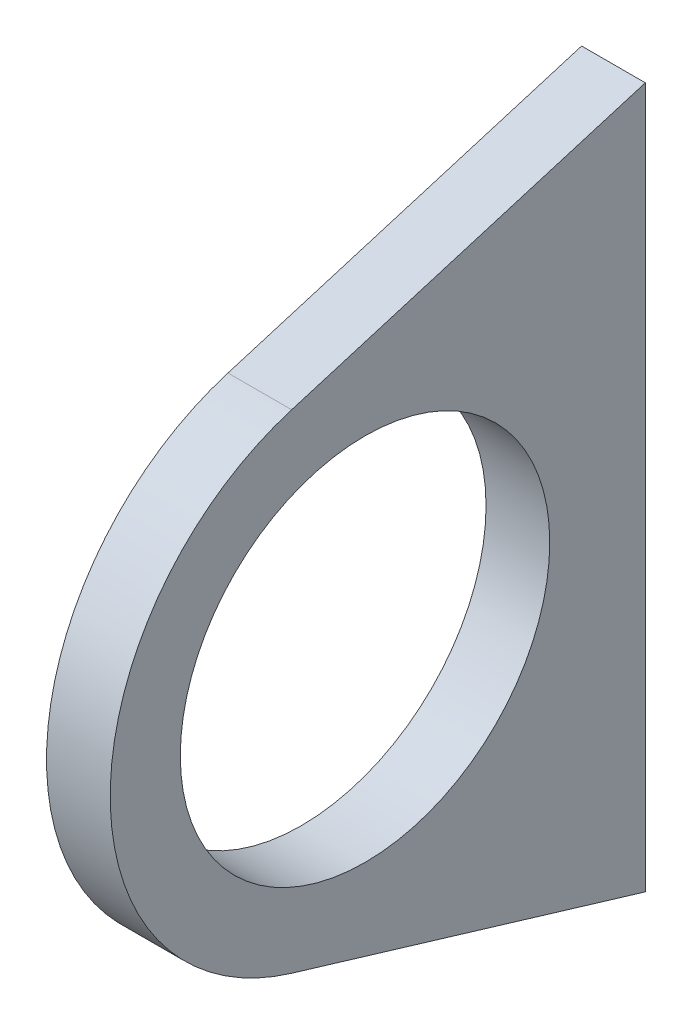
ISO-10303-21;
HEADER;
FILE_DESCRIPTION(('STEP AP214'),'2;1');
FILE_NAME('part.step','',(''),(''),'','','');
FILE_SCHEMA(('AUTOMOTIVE_DESIGN { 1 0 10303 214 1 1 1 1 }'));
ENDSEC;
DATA;
#1=APPLICATION_CONTEXT('core data for automotive mechanical design processes');
#2=APPLICATION_PROTOCOL_DEFINITION('international standard','automotive_design',2000,#1);
#3=PRODUCT_CONTEXT('',#1,'mechanical');
#4=PRODUCT('Part','Part','',(#3));
#5=PRODUCT_RELATED_PRODUCT_CATEGORY('part','',(#4));
#6=PRODUCT_DEFINITION_FORMATION('','',#4);
#7=PRODUCT_DEFINITION_CONTEXT('part definition',#1,'design');
#8=PRODUCT_DEFINITION('design','',#6,#7);
#9=PRODUCT_DEFINITION_SHAPE('','',#8);
#10=(LENGTH_UNIT() NAMED_UNIT(*) SI_UNIT(.MILLI.,.METRE.));
#11=(NAMED_UNIT(*) PLANE_ANGLE_UNIT() SI_UNIT($,.RADIAN.));
#12=(NAMED_UNIT(*) SI_UNIT($,.STERADIAN.) SOLID_ANGLE_UNIT());
#13=UNCERTAINTY_MEASURE_WITH_UNIT(LENGTH_MEASURE(1.E-05),#10,'distance_accuracy_value','');
#14=(GEOMETRIC_REPRESENTATION_CONTEXT(3) GLOBAL_UNCERTAINTY_ASSIGNED_CONTEXT((#13)) GLOBAL_UNIT_ASSIGNED_CONTEXT((#10,
#11,#12)) REPRESENTATION_CONTEXT('',''));
#15=CARTESIAN_POINT('',(0.,0.,0.));
#16=DIRECTION('',(0.,0.,1.));
#17=DIRECTION('',(1.,0.,0.));
#18=AXIS2_PLACEMENT_3D('',#15,#16,#17);
#19=CARTESIAN_POINT('',(-59.,-38.3056788159798,11.5184621563384));
#20=DIRECTION('',(0.,0.957641970399494,-0.287961553908459));
#21=DIRECTION('',(0.,0.287961553908459,0.957641970399494));
#22=AXIS2_PLACEMENT_3D('',#19,#20,#21);
#23=PLANE('',#22);
#24=DIRECTION('',(0.,0.287961553908459,0.957641970399494));
#25=VECTOR('',#24,1.);
#26=CARTESIAN_POINT('',(-69.,-38.3056788159798,11.5184621563384));
#27=LINE('',#26,#25);
#28=CARTESIAN_POINT('',(-69.,-55.,-44.));
#29=VERTEX_POINT('',#28);
#30=CARTESIAN_POINT('',(-69.,-38.3056788159798,11.5184621563384));
#31=VERTEX_POINT('',#30);
#32=EDGE_CURVE('E104',#29,#31,#27,.T.);
#33=ORIENTED_EDGE('',*,*,#32,.F.);
#34=DIRECTION('',(-1.,0.,0.));
#35=VECTOR('',#34,1.);
#36=CARTESIAN_POINT('',(-59.,-55.,-44.));
#37=LINE('',#36,#35);
#38=CARTESIAN_POINT('',(-59.,-55.,-44.));
#39=VERTEX_POINT('',#38);
#40=EDGE_CURVE('E39',#39,#29,#37,.T.);
#41=ORIENTED_EDGE('',*,*,#40,.F.);
#42=DIRECTION('',(0.,0.287961553908459,0.957641970399494));
#43=VECTOR('',#42,1.);
#44=CARTESIAN_POINT('',(-59.,-38.3056788159798,11.5184621563384));
#45=LINE('',#44,#43);
#46=CARTESIAN_POINT('',(-59.,-38.3056788159798,11.5184621563384));
#47=VERTEX_POINT('',#46);
#48=EDGE_CURVE('E90',#39,#47,#45,.T.);
#49=ORIENTED_EDGE('',*,*,#48,.T.);
#50=DIRECTION('',(-1.,0.,0.));
#51=VECTOR('',#50,1.);
#52=CARTESIAN_POINT('',(-59.,-38.3056788159798,11.5184621563384));
#53=LINE('',#52,#51);
#54=EDGE_CURVE('E11',#47,#31,#53,.T.);
#55=ORIENTED_EDGE('',*,*,#54,.T.);
#56=EDGE_LOOP('',(#33,#41,#49,#55));
#57=FACE_BOUND('',#56,.T.);
#58=ADVANCED_FACE('F36',(#57),#23,.F.);
#59=CARTESIAN_POINT('',(-59.,0.,0.));
#60=DIRECTION('',(-1.,0.,0.));
#61=DIRECTION('',(0.,0.,-1.));
#62=AXIS2_PLACEMENT_3D('',#59,#60,#61);
#63=CYLINDRICAL_SURFACE('',#62,40.);
#64=CARTESIAN_POINT('',(-69.,0.,0.));
#65=DIRECTION('',(1.,0.,0.));
#66=DIRECTION('',(0.,0.,-1.));
#67=AXIS2_PLACEMENT_3D('',#64,#65,#66);
#68=CIRCLE('',#67,40.);
#69=CARTESIAN_POINT('',(-69.,38.3056788159798,11.5184621563384));
#70=VERTEX_POINT('',#69);
#71=EDGE_CURVE('E77',#70,#31,#68,.T.);
#72=ORIENTED_EDGE('',*,*,#71,.T.);
#73=ORIENTED_EDGE('',*,*,#54,.F.);
#74=CARTESIAN_POINT('',(-59.,0.,0.));
#75=DIRECTION('',(1.,0.,0.));
#76=DIRECTION('',(0.,0.,-1.));
#77=AXIS2_PLACEMENT_3D('',#74,#75,#76);
#78=CIRCLE('',#77,40.);
#79=CARTESIAN_POINT('',(-59.,38.3056788159798,11.5184621563384));
#80=VERTEX_POINT('',#79);
#81=EDGE_CURVE('E54',#80,#47,#78,.T.);
#82=ORIENTED_EDGE('',*,*,#81,.F.);
#83=DIRECTION('',(-1.,0.,0.));
#84=VECTOR('',#83,1.);
#85=CARTESIAN_POINT('',(-59.,38.3056788159798,11.5184621563384));
#86=LINE('',#85,#84);
#87=EDGE_CURVE('E45',#80,#70,#86,.T.);
#88=ORIENTED_EDGE('',*,*,#87,.T.);
#89=EDGE_LOOP('',(#72,#73,#82,#88));
#90=FACE_BOUND('',#89,.T.);
#91=ADVANCED_FACE('F113',(#90),#63,.T.);
#92=CARTESIAN_POINT('',(-59.,38.3056788159798,11.5184621563384));
#93=DIRECTION('',(0.,-0.957641970399494,-0.287961553908459));
#94=DIRECTION('',(0.,0.287961553908459,-0.957641970399494));
#95=AXIS2_PLACEMENT_3D('',#92,#93,#94);
#96=PLANE('',#95);
#97=DIRECTION('',(0.,0.287961553908459,-0.957641970399494));
#98=VECTOR('',#97,1.);
#99=CARTESIAN_POINT('',(-69.,38.3056788159798,11.5184621563384));
#100=LINE('',#99,#98);
#101=CARTESIAN_POINT('',(-69.,55.,-44.));
#102=VERTEX_POINT('',#101);
#103=EDGE_CURVE('E71',#70,#102,#100,.T.);
#104=ORIENTED_EDGE('',*,*,#103,.F.);
#105=ORIENTED_EDGE('',*,*,#87,.F.);
#106=DIRECTION('',(0.,0.287961553908459,-0.957641970399494));
#107=VECTOR('',#106,1.);
#108=CARTESIAN_POINT('',(-59.,38.3056788159798,11.5184621563384));
#109=LINE('',#108,#107);
#110=CARTESIAN_POINT('',(-59.,55.,-44.));
#111=VERTEX_POINT('',#110);
#112=EDGE_CURVE('E88',#80,#111,#109,.T.);
#113=ORIENTED_EDGE('',*,*,#112,.T.);
#114=DIRECTION('',(-1.,0.,0.));
#115=VECTOR('',#114,1.);
#116=CARTESIAN_POINT('',(-59.,55.,-44.));
#117=LINE('',#116,#115);
#118=EDGE_CURVE('E93',#111,#102,#117,.T.);
#119=ORIENTED_EDGE('',*,*,#118,.T.);
#120=EDGE_LOOP('',(#104,#105,#113,#119));
#121=FACE_BOUND('',#120,.T.);
#122=ADVANCED_FACE('F96',(#121),#96,.F.);
#123=CARTESIAN_POINT('',(-59.,0.,-44.));
#124=DIRECTION('',(0.,0.,-1.));
#125=DIRECTION('',(0.,1.,0.));
#126=AXIS2_PLACEMENT_3D('',#123,#124,#125);
#127=PLANE('',#126);
#128=DIRECTION('',(0.,1.,0.));
#129=VECTOR('',#128,1.);
#130=CARTESIAN_POINT('',(-69.,0.,-44.));
#131=LINE('',#130,#129);
#132=EDGE_CURVE('E95',#29,#102,#131,.T.);
#133=ORIENTED_EDGE('',*,*,#132,.T.);
#134=ORIENTED_EDGE('',*,*,#118,.F.);
#135=DIRECTION('',(0.,1.,0.));
#136=VECTOR('',#135,1.);
#137=CARTESIAN_POINT('',(-59.,0.,-44.));
#138=LINE('',#137,#136);
#139=EDGE_CURVE('E84',#39,#111,#138,.T.);
#140=ORIENTED_EDGE('',*,*,#139,.F.);
#141=ORIENTED_EDGE('',*,*,#40,.T.);
#142=EDGE_LOOP('',(#133,#134,#140,#141));
#143=FACE_BOUND('',#142,.T.);
#144=ADVANCED_FACE('F94',(#143),#127,.T.);
#145=CARTESIAN_POINT('',(-59.,0.,0.));
#146=DIRECTION('',(-1.,0.,0.));
#147=DIRECTION('',(0.,0.,-1.));
#148=AXIS2_PLACEMENT_3D('',#145,#146,#147);
#149=CYLINDRICAL_SURFACE('',#148,29.);
#150=CARTESIAN_POINT('',(-59.,0.,0.));
#151=DIRECTION('',(1.,0.,0.));
#152=DIRECTION('',(0.,0.,-1.));
#153=AXIS2_PLACEMENT_3D('',#150,#151,#152);
#154=CIRCLE('',#153,29.);
#155=CARTESIAN_POINT('',(-59.,0.,-29.));
#156=VERTEX_POINT('',#155);
#157=EDGE_CURVE('E98',#156,#156,#154,.F.);
#158=ORIENTED_EDGE('',*,*,#157,.F.);
#159=EDGE_LOOP('',(#158));
#160=FACE_BOUND('',#159,.T.);
#161=CARTESIAN_POINT('',(-69.,0.,0.));
#162=DIRECTION('',(1.,0.,0.));
#163=DIRECTION('',(0.,0.,-1.));
#164=AXIS2_PLACEMENT_3D('',#161,#162,#163);
#165=CIRCLE('',#164,29.);
#166=CARTESIAN_POINT('',(-69.,0.,-29.));
#167=VERTEX_POINT('',#166);
#168=EDGE_CURVE('E110',#167,#167,#165,.F.);
#169=ORIENTED_EDGE('',*,*,#168,.T.);
#170=EDGE_LOOP('',(#169));
#171=FACE_BOUND('',#170,.T.);
#172=ADVANCED_FACE('F129',(#160,#171),#149,.F.);
#173=CARTESIAN_POINT('',(-59.,0.,0.));
#174=DIRECTION('',(-1.,0.,0.));
#175=DIRECTION('',(0.,0.,-1.));
#176=AXIS2_PLACEMENT_3D('',#173,#174,#175);
#177=PLANE('',#176);
#178=ORIENTED_EDGE('',*,*,#48,.F.);
#179=ORIENTED_EDGE('',*,*,#139,.T.);
#180=ORIENTED_EDGE('',*,*,#112,.F.);
#181=ORIENTED_EDGE('',*,*,#81,.T.);
#182=EDGE_LOOP('',(#178,#179,#180,#181));
#183=FACE_BOUND('',#182,.T.);
#184=ORIENTED_EDGE('',*,*,#157,.T.);
#185=EDGE_LOOP('',(#184));
#186=FACE_BOUND('',#185,.T.);
#187=ADVANCED_FACE('F85',(#183,#186),#177,.F.);
#188=CARTESIAN_POINT('',(-69.,0.,0.));
#189=DIRECTION('',(-1.,0.,0.));
#190=DIRECTION('',(0.,0.,-1.));
#191=AXIS2_PLACEMENT_3D('',#188,#189,#190);
#192=PLANE('',#191);
#193=ORIENTED_EDGE('',*,*,#32,.T.);
#194=ORIENTED_EDGE('',*,*,#71,.F.);
#195=ORIENTED_EDGE('',*,*,#103,.T.);
#196=ORIENTED_EDGE('',*,*,#132,.F.);
#197=EDGE_LOOP('',(#193,#194,#195,#196));
#198=FACE_BOUND('',#197,.T.);
#199=ORIENTED_EDGE('',*,*,#168,.F.);
#200=EDGE_LOOP('',(#199));
#201=FACE_BOUND('',#200,.T.);
#202=ADVANCED_FACE('F115',(#198,#201),#192,.T.);
#203=CLOSED_SHELL('',(#58,#91,#122,#144,#172,#187,#202));
#204=MANIFOLD_SOLID_BREP('B2',#203);
#205=ADVANCED_BREP_SHAPE_REPRESENTATION('',(#18,#204),#14);
#206=SHAPE_DEFINITION_REPRESENTATION(#9,#205);
ENDSEC;
END-ISO-10303-21;
